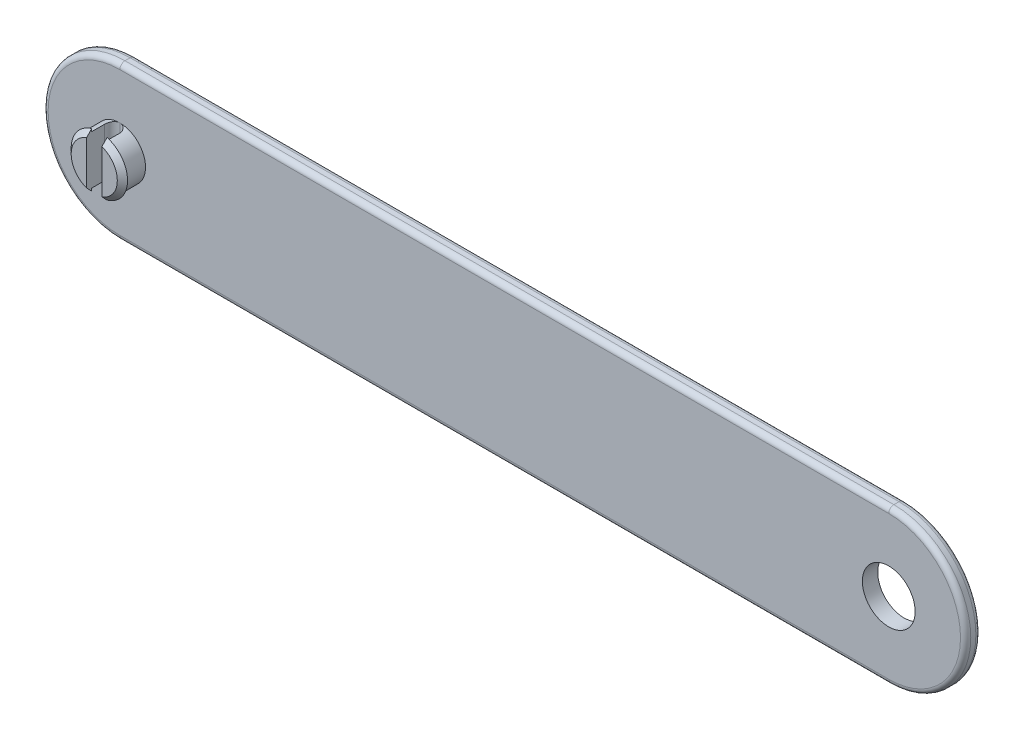
ISO-10303-21;
HEADER;
FILE_DESCRIPTION(('STEP AP214'),'2;1');
FILE_NAME('part.step','',(''),(''),'','','');
FILE_SCHEMA(('AUTOMOTIVE_DESIGN { 1 0 10303 214 1 1 1 1 }'));
ENDSEC;
DATA;
#1=APPLICATION_CONTEXT('core data for automotive mechanical design processes');
#2=APPLICATION_PROTOCOL_DEFINITION('international standard','automotive_design',2000,#1);
#3=PRODUCT_CONTEXT('',#1,'mechanical');
#4=PRODUCT('Part','Part','',(#3));
#5=PRODUCT_RELATED_PRODUCT_CATEGORY('part','',(#4));
#6=PRODUCT_DEFINITION_FORMATION('','',#4);
#7=PRODUCT_DEFINITION_CONTEXT('part definition',#1,'design');
#8=PRODUCT_DEFINITION('design','',#6,#7);
#9=PRODUCT_DEFINITION_SHAPE('','',#8);
#10=(LENGTH_UNIT() NAMED_UNIT(*) SI_UNIT(.MILLI.,.METRE.));
#11=(NAMED_UNIT(*) PLANE_ANGLE_UNIT() SI_UNIT($,.RADIAN.));
#12=(NAMED_UNIT(*) SI_UNIT($,.STERADIAN.) SOLID_ANGLE_UNIT());
#13=UNCERTAINTY_MEASURE_WITH_UNIT(LENGTH_MEASURE(1.E-05),#10,'distance_accuracy_value','');
#14=(GEOMETRIC_REPRESENTATION_CONTEXT(3) GLOBAL_UNCERTAINTY_ASSIGNED_CONTEXT((#13)) GLOBAL_UNIT_ASSIGNED_CONTEXT((#10,
#11,#12)) REPRESENTATION_CONTEXT('',''));
#15=CARTESIAN_POINT('',(0.,0.,0.));
#16=DIRECTION('',(0.,0.,1.));
#17=DIRECTION('',(1.,0.,0.));
#18=AXIS2_PLACEMENT_3D('',#15,#16,#17);
#19=CARTESIAN_POINT('',(0.,0.,3.));
#20=DIRECTION('',(0.,0.,1.));
#21=DIRECTION('',(1.,0.,0.));
#22=AXIS2_PLACEMENT_3D('',#19,#20,#21);
#23=PLANE('',#22);
#24=DIRECTION('',(1.,0.,0.));
#25=VECTOR('',#24,1.);
#26=CARTESIAN_POINT('',(0.,14.,3.));
#27=LINE('',#26,#25);
#28=CARTESIAN_POINT('',(150.,14.,3.));
#29=VERTEX_POINT('',#28);
#30=CARTESIAN_POINT('',(0.,14.,3.));
#31=VERTEX_POINT('',#30);
#32=EDGE_CURVE('E318',#29,#31,#27,.F.);
#33=ORIENTED_EDGE('',*,*,#32,.T.);
#34=CARTESIAN_POINT('',(0.,0.,3.));
#35=DIRECTION('',(0.,0.,1.));
#36=DIRECTION('',(1.,0.,0.));
#37=AXIS2_PLACEMENT_3D('',#34,#35,#36);
#38=CIRCLE('',#37,14.);
#39=CARTESIAN_POINT('',(0.,-14.,3.));
#40=VERTEX_POINT('',#39);
#41=EDGE_CURVE('E323',#31,#40,#38,.T.);
#42=ORIENTED_EDGE('',*,*,#41,.T.);
#43=DIRECTION('',(1.,0.,0.));
#44=VECTOR('',#43,1.);
#45=CARTESIAN_POINT('',(150.,-14.,3.));
#46=LINE('',#45,#44);
#47=CARTESIAN_POINT('',(150.,-14.,3.));
#48=VERTEX_POINT('',#47);
#49=EDGE_CURVE('E63',#40,#48,#46,.T.);
#50=ORIENTED_EDGE('',*,*,#49,.T.);
#51=CARTESIAN_POINT('',(150.,0.,3.));
#52=DIRECTION('',(0.,0.,1.));
#53=DIRECTION('',(1.,0.,0.));
#54=AXIS2_PLACEMENT_3D('',#51,#52,#53);
#55=CIRCLE('',#54,14.);
#56=EDGE_CURVE('E320',#48,#29,#55,.T.);
#57=ORIENTED_EDGE('',*,*,#56,.T.);
#58=EDGE_LOOP('',(#33,#42,#50,#57));
#59=FACE_BOUND('',#58,.T.);
#60=CARTESIAN_POINT('',(150.,0.,3.));
#61=DIRECTION('',(0.,0.,1.));
#62=DIRECTION('',(1.,0.,0.));
#63=AXIS2_PLACEMENT_3D('',#60,#61,#62);
#64=CIRCLE('',#63,5.14999999999998);
#65=CARTESIAN_POINT('',(155.15,0.,3.));
#66=VERTEX_POINT('',#65);
#67=EDGE_CURVE('E399',#66,#66,#64,.F.);
#68=ORIENTED_EDGE('',*,*,#67,.T.);
#69=EDGE_LOOP('',(#68));
#70=FACE_BOUND('',#69,.T.);
#71=CARTESIAN_POINT('',(0.,0.,3.));
#72=DIRECTION('',(0.,0.,1.));
#73=DIRECTION('',(1.,0.,0.));
#74=AXIS2_PLACEMENT_3D('',#71,#72,#73);
#75=CIRCLE('',#74,5.);
#76=CARTESIAN_POINT('',(0.,5.,3.));
#77=VERTEX_POINT('',#76);
#78=CARTESIAN_POINT('',(0.,-5.,3.));
#79=VERTEX_POINT('',#78);
#80=EDGE_CURVE('E378',#77,#79,#75,.T.);
#81=ORIENTED_EDGE('',*,*,#80,.F.);
#82=CARTESIAN_POINT('',(0.,0.,3.));
#83=DIRECTION('',(0.,0.,1.));
#84=DIRECTION('',(1.,0.,0.));
#85=AXIS2_PLACEMENT_3D('',#82,#83,#84);
#86=CIRCLE('',#85,5.);
#87=EDGE_CURVE('E380',#79,#77,#86,.T.);
#88=ORIENTED_EDGE('',*,*,#87,.F.);
#89=EDGE_LOOP('',(#81,#88));
#90=FACE_BOUND('',#89,.T.);
#91=ADVANCED_FACE('F39',(#59,#70,#90),#23,.T.);
#92=CARTESIAN_POINT('',(0.,0.,3.));
#93=DIRECTION('',(0.,0.,-1.));
#94=DIRECTION('',(-1.,0.,0.));
#95=AXIS2_PLACEMENT_3D('',#92,#93,#94);
#96=CYLINDRICAL_SURFACE('',#95,15.);
#97=DIRECTION('',(0.,0.,-1.));
#98=VECTOR('',#97,1.);
#99=CARTESIAN_POINT('',(0.,15.,3.));
#100=LINE('',#99,#98);
#101=CARTESIAN_POINT('',(0.,15.,2.));
#102=VERTEX_POINT('',#101);
#103=CARTESIAN_POINT('',(0.,15.,1.));
#104=VERTEX_POINT('',#103);
#105=EDGE_CURVE('E366',#102,#104,#100,.T.);
#106=ORIENTED_EDGE('',*,*,#105,.T.);
#107=CARTESIAN_POINT('',(0.,0.,1.));
#108=DIRECTION('',(0.,0.,1.));
#109=DIRECTION('',(1.,0.,0.));
#110=AXIS2_PLACEMENT_3D('',#107,#108,#109);
#111=CIRCLE('',#110,15.);
#112=CARTESIAN_POINT('',(0.,-15.,1.));
#113=VERTEX_POINT('',#112);
#114=EDGE_CURVE('E298',#104,#113,#111,.T.);
#115=ORIENTED_EDGE('',*,*,#114,.T.);
#116=DIRECTION('',(0.,0.,-1.));
#117=VECTOR('',#116,1.);
#118=CARTESIAN_POINT('',(0.,-15.,3.));
#119=LINE('',#118,#117);
#120=CARTESIAN_POINT('',(0.,-15.,2.));
#121=VERTEX_POINT('',#120);
#122=EDGE_CURVE('E193',#121,#113,#119,.T.);
#123=ORIENTED_EDGE('',*,*,#122,.F.);
#124=CARTESIAN_POINT('',(0.,0.,2.));
#125=DIRECTION('',(0.,0.,1.));
#126=DIRECTION('',(1.,0.,0.));
#127=AXIS2_PLACEMENT_3D('',#124,#125,#126);
#128=CIRCLE('',#127,15.);
#129=EDGE_CURVE('E290',#121,#102,#128,.F.);
#130=ORIENTED_EDGE('',*,*,#129,.T.);
#131=EDGE_LOOP('',(#106,#115,#123,#130));
#132=FACE_BOUND('',#131,.T.);
#133=ADVANCED_FACE('F418',(#132),#96,.T.);
#134=CARTESIAN_POINT('',(0.,-15.,3.));
#135=DIRECTION('',(0.,1.,0.));
#136=DIRECTION('',(0.,0.,1.));
#137=AXIS2_PLACEMENT_3D('',#134,#135,#136);
#138=PLANE('',#137);
#139=ORIENTED_EDGE('',*,*,#122,.T.);
#140=DIRECTION('',(1.,0.,0.));
#141=VECTOR('',#140,1.);
#142=CARTESIAN_POINT('',(0.,-15.,1.));
#143=LINE('',#142,#141);
#144=CARTESIAN_POINT('',(150.,-15.,1.));
#145=VERTEX_POINT('',#144);
#146=EDGE_CURVE('E312',#113,#145,#143,.T.);
#147=ORIENTED_EDGE('',*,*,#146,.T.);
#148=DIRECTION('',(0.,0.,-1.));
#149=VECTOR('',#148,1.);
#150=CARTESIAN_POINT('',(150.,-15.,3.));
#151=LINE('',#150,#149);
#152=CARTESIAN_POINT('',(150.,-15.,2.));
#153=VERTEX_POINT('',#152);
#154=EDGE_CURVE('E356',#153,#145,#151,.T.);
#155=ORIENTED_EDGE('',*,*,#154,.F.);
#156=DIRECTION('',(1.,0.,0.));
#157=VECTOR('',#156,1.);
#158=CARTESIAN_POINT('',(0.,-15.,2.));
#159=LINE('',#158,#157);
#160=EDGE_CURVE('E310',#153,#121,#159,.F.);
#161=ORIENTED_EDGE('',*,*,#160,.T.);
#162=EDGE_LOOP('',(#139,#147,#155,#161));
#163=FACE_BOUND('',#162,.T.);
#164=ADVANCED_FACE('F362',(#163),#138,.F.);
#165=CARTESIAN_POINT('',(150.,0.,3.));
#166=DIRECTION('',(0.,0.,-1.));
#167=DIRECTION('',(-1.,0.,0.));
#168=AXIS2_PLACEMENT_3D('',#165,#166,#167);
#169=CYLINDRICAL_SURFACE('',#168,15.);
#170=ORIENTED_EDGE('',*,*,#154,.T.);
#171=CARTESIAN_POINT('',(150.,0.,1.));
#172=DIRECTION('',(0.,0.,1.));
#173=DIRECTION('',(1.,0.,0.));
#174=AXIS2_PLACEMENT_3D('',#171,#172,#173);
#175=CIRCLE('',#174,15.);
#176=CARTESIAN_POINT('',(150.,15.,1.));
#177=VERTEX_POINT('',#176);
#178=EDGE_CURVE('E316',#145,#177,#175,.T.);
#179=ORIENTED_EDGE('',*,*,#178,.T.);
#180=DIRECTION('',(0.,0.,-1.));
#181=VECTOR('',#180,1.);
#182=CARTESIAN_POINT('',(150.,15.,3.));
#183=LINE('',#182,#181);
#184=CARTESIAN_POINT('',(150.,15.,2.));
#185=VERTEX_POINT('',#184);
#186=EDGE_CURVE('E359',#185,#177,#183,.T.);
#187=ORIENTED_EDGE('',*,*,#186,.F.);
#188=CARTESIAN_POINT('',(150.,0.,2.));
#189=DIRECTION('',(0.,0.,1.));
#190=DIRECTION('',(1.,0.,0.));
#191=AXIS2_PLACEMENT_3D('',#188,#189,#190);
#192=CIRCLE('',#191,15.);
#193=EDGE_CURVE('E314',#185,#153,#192,.F.);
#194=ORIENTED_EDGE('',*,*,#193,.T.);
#195=EDGE_LOOP('',(#170,#179,#187,#194));
#196=FACE_BOUND('',#195,.T.);
#197=ADVANCED_FACE('F355',(#196),#169,.T.);
#198=CARTESIAN_POINT('',(0.,15.,3.));
#199=DIRECTION('',(0.,1.,0.));
#200=DIRECTION('',(0.,0.,1.));
#201=AXIS2_PLACEMENT_3D('',#198,#199,#200);
#202=PLANE('',#201);
#203=ORIENTED_EDGE('',*,*,#186,.T.);
#204=DIRECTION('',(1.,0.,0.));
#205=VECTOR('',#204,1.);
#206=CARTESIAN_POINT('',(0.,15.,1.));
#207=LINE('',#206,#205);
#208=EDGE_CURVE('E11',#177,#104,#207,.F.);
#209=ORIENTED_EDGE('',*,*,#208,.T.);
#210=ORIENTED_EDGE('',*,*,#105,.F.);
#211=DIRECTION('',(1.,0.,0.));
#212=VECTOR('',#211,1.);
#213=CARTESIAN_POINT('',(0.,15.,2.));
#214=LINE('',#213,#212);
#215=EDGE_CURVE('E48',#102,#185,#214,.T.);
#216=ORIENTED_EDGE('',*,*,#215,.T.);
#217=EDGE_LOOP('',(#203,#209,#210,#216));
#218=FACE_BOUND('',#217,.T.);
#219=ADVANCED_FACE('F427',(#218),#202,.T.);
#220=CARTESIAN_POINT('',(0.,0.,0.));
#221=DIRECTION('',(0.,0.,1.));
#222=DIRECTION('',(1.,0.,0.));
#223=AXIS2_PLACEMENT_3D('',#220,#221,#222);
#224=PLANE('',#223);
#225=DIRECTION('',(1.,0.,0.));
#226=VECTOR('',#225,1.);
#227=CARTESIAN_POINT('',(0.,-14.,0.));
#228=LINE('',#227,#226);
#229=CARTESIAN_POINT('',(150.,-14.,0.));
#230=VERTEX_POINT('',#229);
#231=CARTESIAN_POINT('',(0.,-14.,0.));
#232=VERTEX_POINT('',#231);
#233=EDGE_CURVE('E305',#230,#232,#228,.F.);
#234=ORIENTED_EDGE('',*,*,#233,.T.);
#235=CARTESIAN_POINT('',(0.,0.,0.));
#236=DIRECTION('',(0.,0.,1.));
#237=DIRECTION('',(1.,0.,0.));
#238=AXIS2_PLACEMENT_3D('',#235,#236,#237);
#239=CIRCLE('',#238,14.);
#240=CARTESIAN_POINT('',(0.,14.,0.));
#241=VERTEX_POINT('',#240);
#242=EDGE_CURVE('E307',#232,#241,#239,.F.);
#243=ORIENTED_EDGE('',*,*,#242,.T.);
#244=DIRECTION('',(1.,0.,0.));
#245=VECTOR('',#244,1.);
#246=CARTESIAN_POINT('',(150.,14.,0.));
#247=LINE('',#246,#245);
#248=CARTESIAN_POINT('',(150.,14.,0.));
#249=VERTEX_POINT('',#248);
#250=EDGE_CURVE('E301',#241,#249,#247,.T.);
#251=ORIENTED_EDGE('',*,*,#250,.T.);
#252=CARTESIAN_POINT('',(150.,0.,0.));
#253=DIRECTION('',(0.,0.,1.));
#254=DIRECTION('',(1.,0.,0.));
#255=AXIS2_PLACEMENT_3D('',#252,#253,#254);
#256=CIRCLE('',#255,14.);
#257=EDGE_CURVE('E303',#249,#230,#256,.F.);
#258=ORIENTED_EDGE('',*,*,#257,.T.);
#259=EDGE_LOOP('',(#234,#243,#251,#258));
#260=FACE_BOUND('',#259,.T.);
#261=CARTESIAN_POINT('',(150.,0.,0.));
#262=DIRECTION('',(0.,0.,1.));
#263=DIRECTION('',(1.,0.,0.));
#264=AXIS2_PLACEMENT_3D('',#261,#262,#263);
#265=CIRCLE('',#264,5.14999999999998);
#266=CARTESIAN_POINT('',(155.15,0.,0.));
#267=VERTEX_POINT('',#266);
#268=EDGE_CURVE('E294',#267,#267,#265,.T.);
#269=ORIENTED_EDGE('',*,*,#268,.T.);
#270=EDGE_LOOP('',(#269));
#271=FACE_BOUND('',#270,.T.);
#272=ADVANCED_FACE('F406',(#260,#271),#224,.F.);
#273=CARTESIAN_POINT('',(0.,0.,7.));
#274=DIRECTION('',(0.,0.,-1.));
#275=DIRECTION('',(-1.,0.,0.));
#276=AXIS2_PLACEMENT_3D('',#273,#274,#275);
#277=CYLINDRICAL_SURFACE('',#276,5.);
#278=ORIENTED_EDGE('',*,*,#80,.T.);
#279=CARTESIAN_POINT('',(0.,-5.,3.));
#280=CARTESIAN_POINT('',(-0.0412230773899798,-5.00000277613312,2.99999925912565));
#281=CARTESIAN_POINT('',(-0.082425557098246,-4.99948958398081,3.00170043926399));
#282=CARTESIAN_POINT('',(-0.164518730866947,-4.99746087704898,3.00848041599295));
#283=CARTESIAN_POINT('',(-0.205409485177793,-4.9959455611979,3.01355854223773));
#284=CARTESIAN_POINT('',(-0.326963301776201,-4.98995381331756,3.03377517530363));
#285=CARTESIAN_POINT('',(-0.406785158642713,-4.98403118606551,3.05389634922364));
#286=CARTESIAN_POINT('',(-0.561734538434264,-4.96895678681408,3.10674287914124));
#287=CARTESIAN_POINT('',(-0.636863069535107,-4.95980571114645,3.13946551731626));
#288=CARTESIAN_POINT('',(-0.780600785691843,-4.9392243551907,3.21652309467646));
#289=CARTESIAN_POINT('',(-0.849207204843492,-4.92779311423826,3.2608629308205));
#290=CARTESIAN_POINT('',(-0.97986969539363,-4.90350796272656,3.36122156640607));
#291=CARTESIAN_POINT('',(-1.0417124952522,-4.8906250718143,3.41751086871889));
#292=CARTESIAN_POINT('',(-1.15524422121796,-4.86505948668359,3.53960362636054));
#293=CARTESIAN_POINT('',(-1.20693049442307,-4.85237684556416,3.6054095596784));
#294=CARTESIAN_POINT('',(-1.29981663905891,-4.82833698781928,3.74649383123076));
#295=CARTESIAN_POINT('',(-1.34075062074078,-4.81701657361783,3.82195389706853));
#296=CARTESIAN_POINT('',(-1.40923482373452,-4.79742985037451,3.97905482734796));
#297=CARTESIAN_POINT('',(-1.43679764279335,-4.78916066835566,4.06068978989199));
#298=CARTESIAN_POINT('',(-1.47137173672671,-4.77862845517374,4.20226791879962));
#299=CARTESIAN_POINT('',(-1.48208442594249,-4.77530350348451,4.26125369965697));
#300=CARTESIAN_POINT('',(-1.49640626854262,-4.7708262463819,4.38014739106727));
#301=CARTESIAN_POINT('',(-1.5000169977961,-4.76967345898471,4.44005509407892));
#302=CARTESIAN_POINT('',(-1.5,-4.76969600708473,4.5));
#303=B_SPLINE_CURVE_WITH_KNOTS('',3,(#279,#280,#281,#282,#283,#284,#285,#286,#287,#288,#289,
#290,#291,#292,#293,#294,#295,#296,#297,#298,#299,#300,#301,#302),.UNSPECIFIED.,.F.,.F.,(4,2,2,
2,2,2,2,2,2,2,2,4),(0.,0.123590522760266,0.247156519315276,0.493467728235495,0.739725843675752,
0.986087930955972,1.23877207809718,1.49152213929098,1.75003354782293,2.00830092246139,
2.18798745648376,2.36763411497588),.UNSPECIFIED.);
#304=CARTESIAN_POINT('',(-1.5,-4.76969600708473,4.5));
#305=VERTEX_POINT('',#304);
#306=EDGE_CURVE('E284',#79,#305,#303,.T.);
#307=ORIENTED_EDGE('',*,*,#306,.T.);
#308=DIRECTION('',(0.,0.,-1.));
#309=VECTOR('',#308,1.);
#310=CARTESIAN_POINT('',(-1.5,-4.76969600708473,7.));
#311=LINE('',#310,#309);
#312=CARTESIAN_POINT('',(-1.5,-4.76969600708473,7.));
#313=VERTEX_POINT('',#312);
#314=EDGE_CURVE('E371',#313,#305,#311,.T.);
#315=ORIENTED_EDGE('',*,*,#314,.F.);
#316=CARTESIAN_POINT('',(0.,0.,7.));
#317=DIRECTION('',(0.,0.,1.));
#318=DIRECTION('',(1.,0.,0.));
#319=AXIS2_PLACEMENT_3D('',#316,#317,#318);
#320=CIRCLE('',#319,5.);
#321=CARTESIAN_POINT('',(-1.5,4.76969600708473,7.));
#322=VERTEX_POINT('',#321);
#323=EDGE_CURVE('E377',#322,#313,#320,.T.);
#324=ORIENTED_EDGE('',*,*,#323,.F.);
#325=DIRECTION('',(0.,0.,-1.));
#326=VECTOR('',#325,1.);
#327=CARTESIAN_POINT('',(-1.5,4.76969600708473,7.));
#328=LINE('',#327,#326);
#329=CARTESIAN_POINT('',(-1.5,4.76969600708473,4.5));
#330=VERTEX_POINT('',#329);
#331=EDGE_CURVE('E374',#322,#330,#328,.T.);
#332=ORIENTED_EDGE('',*,*,#331,.T.);
#333=CARTESIAN_POINT('',(-1.5,4.76969600708473,4.5));
#334=CARTESIAN_POINT('',(-1.50000085359986,4.76969248993095,4.45881918932386));
#335=CARTESIAN_POINT('',(-1.49830305374631,4.77023000663726,4.41765912115535));
#336=CARTESIAN_POINT('',(-1.49153727481279,4.77235113343356,4.33565320311231));
#337=CARTESIAN_POINT('',(-1.48647005385463,4.77393450820429,4.29480728464472));
#338=CARTESIAN_POINT('',(-1.46630065235378,4.78018533002168,4.17340395624687));
#339=CARTESIAN_POINT('',(-1.44623028637151,4.78635397305578,4.09369093965724));
#340=CARTESIAN_POINT('',(-1.39353147335906,4.80195939037487,3.93896571877284));
#341=CARTESIAN_POINT('',(-1.36090719903445,4.81139507864529,3.86395196214715));
#342=CARTESIAN_POINT('',(-1.28407985018232,4.8324653260204,3.7204056008968));
#343=CARTESIAN_POINT('',(-1.23987100279312,4.8441009806121,3.65187625084195));
#344=CARTESIAN_POINT('',(-1.13964930893702,4.86866818200433,3.5211348309649));
#345=CARTESIAN_POINT('',(-1.08333633607985,4.88162718483485,3.45915804950034));
#346=CARTESIAN_POINT('',(-0.961140113903202,4.90714781796852,3.34536568202602));
#347=CARTESIAN_POINT('',(-0.895255002005047,4.9197093703538,3.2935520782231));
#348=CARTESIAN_POINT('',(-0.754090160225413,4.94333592434221,3.2005222228324));
#349=CARTESIAN_POINT('',(-0.678642338077988,4.95436400128813,3.15955109688797));
#350=CARTESIAN_POINT('',(-0.521563369050342,4.97335005202751,3.0909932692418));
#351=CARTESIAN_POINT('',(-0.43993764984166,4.98131068415015,3.06339497292421));
#352=CARTESIAN_POINT('',(-0.298264456021694,4.99143710038863,3.02873103887292));
#353=CARTESIAN_POINT('',(-0.239166490668785,4.99462764738926,3.01797863412638));
#354=CARTESIAN_POINT('',(-0.120057391419018,4.99891817852599,3.00360598264217));
#355=CARTESIAN_POINT('',(-0.0600465820525033,5.00001888889584,2.99998325827159));
#356=CARTESIAN_POINT('',(0.,5.,3.));
#357=B_SPLINE_CURVE_WITH_KNOTS('',3,(#333,#334,#335,#336,#337,#338,#339,#340,#341,#342,#343,
#344,#345,#346,#347,#348,#349,#350,#351,#352,#353,#354,#355,#356),.UNSPECIFIED.,.F.,.F.,(4,2,2,
2,2,2,2,2,2,2,2,4),(0.,0.123463321048067,0.246898872168488,0.492911372366582,0.738842172727396,
0.984895759946681,1.23795183323011,1.49105721311967,1.74947248420819,2.00766329935825,
2.1876802778492,2.36763468764484),.UNSPECIFIED.);
#358=EDGE_CURVE('E277',#330,#77,#357,.T.);
#359=ORIENTED_EDGE('',*,*,#358,.T.);
#360=EDGE_LOOP('',(#278,#307,#315,#324,#332,#359));
#361=FACE_BOUND('',#360,.T.);
#362=ADVANCED_FACE('F224',(#361),#277,.T.);
#363=CARTESIAN_POINT('',(-1.5,4.76969600708473,7.));
#364=DIRECTION('',(-1.,0.,0.));
#365=DIRECTION('',(0.,0.,1.));
#366=AXIS2_PLACEMENT_3D('',#363,#364,#365);
#367=PLANE('',#366);
#368=ORIENTED_EDGE('',*,*,#314,.T.);
#369=DIRECTION('',(0.,1.,0.));
#370=VECTOR('',#369,1.);
#371=CARTESIAN_POINT('',(-1.5,4.76969600708473,4.5));
#372=LINE('',#371,#370);
#373=EDGE_CURVE('E705',#305,#330,#372,.T.);
#374=ORIENTED_EDGE('',*,*,#373,.T.);
#375=ORIENTED_EDGE('',*,*,#331,.F.);
#376=DIRECTION('',(0.,1.,0.));
#377=VECTOR('',#376,1.);
#378=CARTESIAN_POINT('',(-1.5,5.29150262212918,7.));
#379=LINE('',#378,#377);
#380=CARTESIAN_POINT('',(-1.5,5.29150262212918,7.));
#381=VERTEX_POINT('',#380);
#382=EDGE_CURVE('E394',#322,#381,#379,.T.);
#383=ORIENTED_EDGE('',*,*,#382,.T.);
#384=CARTESIAN_POINT('',(-1.5,5.29150262212918,7.00000000000001));
#385=CARTESIAN_POINT('',(-1.5,5.20447414806339,7.08372769626351));
#386=CARTESIAN_POINT('',(-1.5,5.11737049196802,7.1673773601956));
#387=CARTESIAN_POINT('',(-1.5,4.94298604304671,7.33449072927142));
#388=CARTESIAN_POINT('',(-1.5,4.85570525133475,7.41795443557776));
#389=CARTESIAN_POINT('',(-1.5,4.68093851584008,7.58466719096905));
#390=CARTESIAN_POINT('',(-1.5,4.59345257170058,7.66791623968014));
#391=CARTESIAN_POINT('',(-1.5,4.41823789495108,7.83415950995));
#392=CARTESIAN_POINT('',(-1.5,4.33050916081913,7.91715372990442));
#393=CARTESIAN_POINT('',(-1.5,4.24264068711932,8.));
#394=B_SPLINE_CURVE_WITH_KNOTS('',3,(#384,#385,#386,#387,#388,#389,#390,#391,#392,#393),
.UNSPECIFIED.,.F.,.F.,(4,2,2,2,4),(0.,0.362296270250921,0.724590269047716,1.08688489839679,
1.44918180400591),.UNSPECIFIED.);
#395=CARTESIAN_POINT('',(-1.5,4.24264068711932,8.));
#396=VERTEX_POINT('',#395);
#397=EDGE_CURVE('E230',#381,#396,#394,.T.);
#398=ORIENTED_EDGE('',*,*,#397,.T.);
#399=DIRECTION('',(0.,1.,0.));
#400=VECTOR('',#399,1.);
#401=CARTESIAN_POINT('',(-1.5,5.29150262212918,8.));
#402=LINE('',#401,#400);
#403=CARTESIAN_POINT('',(-1.5,-4.24264068711932,8.));
#404=VERTEX_POINT('',#403);
#405=EDGE_CURVE('E390',#404,#396,#402,.T.);
#406=ORIENTED_EDGE('',*,*,#405,.F.);
#407=CARTESIAN_POINT('',(-1.5,-4.24264068711932,8.));
#408=CARTESIAN_POINT('',(-1.5,-4.33050916081913,7.91715372990443));
#409=CARTESIAN_POINT('',(-1.5,-4.41823789495108,7.83415950995));
#410=CARTESIAN_POINT('',(-1.5,-4.59345257170058,7.66791623968014));
#411=CARTESIAN_POINT('',(-1.5,-4.68093851584008,7.58466719096905));
#412=CARTESIAN_POINT('',(-1.5,-4.85570525133475,7.41795443557776));
#413=CARTESIAN_POINT('',(-1.5,-4.94298604304671,7.33449072927142));
#414=CARTESIAN_POINT('',(-1.5,-5.11737049196802,7.1673773601956));
#415=CARTESIAN_POINT('',(-1.5,-5.20447414806339,7.08372769626351));
#416=CARTESIAN_POINT('',(-1.5,-5.29150262212918,7.00000000000001));
#417=B_SPLINE_CURVE_WITH_KNOTS('',3,(#407,#408,#409,#410,#411,#412,#413,#414,#415,#416),
.UNSPECIFIED.,.F.,.F.,(4,2,2,2,4),(0.,0.362296905609113,0.724591534958192,1.08688553375499,
1.44918180400591),.UNSPECIFIED.);
#418=CARTESIAN_POINT('',(-1.5,-5.29150262212918,7.));
#419=VERTEX_POINT('',#418);
#420=EDGE_CURVE('E236',#404,#419,#417,.T.);
#421=ORIENTED_EDGE('',*,*,#420,.T.);
#422=EDGE_CURVE('E391',#419,#313,#379,.T.);
#423=ORIENTED_EDGE('',*,*,#422,.T.);
#424=EDGE_LOOP('',(#368,#374,#375,#383,#398,#406,#421,#423));
#425=FACE_BOUND('',#424,.T.);
#426=ADVANCED_FACE('F219',(#425),#367,.F.);
#427=CARTESIAN_POINT('',(0.,0.,7.));
#428=DIRECTION('',(0.,0.,-1.));
#429=DIRECTION('',(-1.,0.,0.));
#430=AXIS2_PLACEMENT_3D('',#427,#428,#429);
#431=CYLINDRICAL_SURFACE('',#430,5.);
#432=ORIENTED_EDGE('',*,*,#87,.T.);
#433=CARTESIAN_POINT('',(0.,5.,3.));
#434=CARTESIAN_POINT('',(0.0412230773899829,5.00000277613312,2.99999925912565));
#435=CARTESIAN_POINT('',(0.0824255570982492,4.99948958398081,3.00170043926399));
#436=CARTESIAN_POINT('',(0.164518730866951,4.99746087704899,3.00848041599295));
#437=CARTESIAN_POINT('',(0.205409485177797,4.9959455611979,3.01355854223773));
#438=CARTESIAN_POINT('',(0.326963301776204,4.98995381331756,3.03377517530363));
#439=CARTESIAN_POINT('',(0.406785158642716,4.98403118606551,3.05389634922364));
#440=CARTESIAN_POINT('',(0.561734538434267,4.96895678681408,3.10674287914124));
#441=CARTESIAN_POINT('',(0.63686306953511,4.95980571114645,3.13946551731626));
#442=CARTESIAN_POINT('',(0.780600785691846,4.9392243551907,3.21652309467646));
#443=CARTESIAN_POINT('',(0.849207204843496,4.92779311423826,3.2608629308205));
#444=CARTESIAN_POINT('',(0.979869695393634,4.90350796272656,3.36122156640607));
#445=CARTESIAN_POINT('',(1.04171249525221,4.8906250718143,3.41751086871889));
#446=CARTESIAN_POINT('',(1.15524422121796,4.86505948668359,3.53960362636055));
#447=CARTESIAN_POINT('',(1.20693049442308,4.85237684556416,3.6054095596784));
#448=CARTESIAN_POINT('',(1.29981663905892,4.82833698781928,3.74649383123077));
#449=CARTESIAN_POINT('',(1.34075062074078,4.81701657361783,3.82195389706853));
#450=CARTESIAN_POINT('',(1.40923482373453,4.79742985037451,3.97905482734796));
#451=CARTESIAN_POINT('',(1.43679764279335,4.78916066835566,4.06068978989199));
#452=CARTESIAN_POINT('',(1.47137173672671,4.77862845517374,4.20226791879962));
#453=CARTESIAN_POINT('',(1.48208442594249,4.77530350348451,4.26125369965697));
#454=CARTESIAN_POINT('',(1.49640626854262,4.7708262463819,4.38014739106727));
#455=CARTESIAN_POINT('',(1.5000169977961,4.7696734589847,4.44005509407892));
#456=CARTESIAN_POINT('',(1.5,4.76969600708473,4.5));
#457=B_SPLINE_CURVE_WITH_KNOTS('',3,(#433,#434,#435,#436,#437,#438,#439,#440,#441,#442,#443,
#444,#445,#446,#447,#448,#449,#450,#451,#452,#453,#454,#455,#456),.UNSPECIFIED.,.F.,.F.,(4,2,2,
2,2,2,2,2,2,2,2,4),(0.,0.123590522760266,0.247156519315276,0.493467728235495,0.739725843675752,
0.986087930955972,1.23877207809718,1.49152213929098,1.75003354782293,2.00830092246139,
2.18798745648376,2.36763411497588),.UNSPECIFIED.);
#458=CARTESIAN_POINT('',(1.5,4.76969600708473,4.5));
#459=VERTEX_POINT('',#458);
#460=EDGE_CURVE('E271',#77,#459,#457,.T.);
#461=ORIENTED_EDGE('',*,*,#460,.T.);
#462=DIRECTION('',(0.,0.,-1.));
#463=VECTOR('',#462,1.);
#464=CARTESIAN_POINT('',(1.5,4.76969600708473,7.));
#465=LINE('',#464,#463);
#466=CARTESIAN_POINT('',(1.5,4.76969600708473,7.));
#467=VERTEX_POINT('',#466);
#468=EDGE_CURVE('E388',#467,#459,#465,.T.);
#469=ORIENTED_EDGE('',*,*,#468,.F.);
#470=CARTESIAN_POINT('',(0.,0.,7.));
#471=DIRECTION('',(0.,0.,1.));
#472=DIRECTION('',(1.,0.,0.));
#473=AXIS2_PLACEMENT_3D('',#470,#471,#472);
#474=CIRCLE('',#473,5.);
#475=CARTESIAN_POINT('',(1.5,-4.76969600708473,7.));
#476=VERTEX_POINT('',#475);
#477=EDGE_CURVE('E383',#476,#467,#474,.T.);
#478=ORIENTED_EDGE('',*,*,#477,.F.);
#479=DIRECTION('',(0.,0.,-1.));
#480=VECTOR('',#479,1.);
#481=CARTESIAN_POINT('',(1.5,-4.76969600708473,7.));
#482=LINE('',#481,#480);
#483=CARTESIAN_POINT('',(1.5,-4.76969600708473,4.5));
#484=VERTEX_POINT('',#483);
#485=EDGE_CURVE('E170',#476,#484,#482,.T.);
#486=ORIENTED_EDGE('',*,*,#485,.T.);
#487=CARTESIAN_POINT('',(1.5,-4.76969600708473,4.5));
#488=CARTESIAN_POINT('',(1.50000085359987,-4.76969248993095,4.45881918932386));
#489=CARTESIAN_POINT('',(1.49830305374632,-4.77023000663726,4.41765912115535));
#490=CARTESIAN_POINT('',(1.49153727481279,-4.77235113343356,4.33565320311231));
#491=CARTESIAN_POINT('',(1.48647005385463,-4.77393450820429,4.29480728464472));
#492=CARTESIAN_POINT('',(1.46630065235378,-4.78018533002168,4.17340395624687));
#493=CARTESIAN_POINT('',(1.44623028637152,-4.78635397305578,4.09369093965724));
#494=CARTESIAN_POINT('',(1.39353147335906,-4.80195939037487,3.93896571877284));
#495=CARTESIAN_POINT('',(1.36090719903445,-4.81139507864529,3.86395196214715));
#496=CARTESIAN_POINT('',(1.28407985018232,-4.8324653260204,3.7204056008968));
#497=CARTESIAN_POINT('',(1.23987100279312,-4.8441009806121,3.65187625084195));
#498=CARTESIAN_POINT('',(1.13964930893702,-4.86866818200433,3.5211348309649));
#499=CARTESIAN_POINT('',(1.08333633607985,-4.88162718483485,3.45915804950034));
#500=CARTESIAN_POINT('',(0.961140113903205,-4.90714781796852,3.34536568202602));
#501=CARTESIAN_POINT('',(0.895255002005051,-4.9197093703538,3.2935520782231));
#502=CARTESIAN_POINT('',(0.754090160225417,-4.94333592434221,3.2005222228324));
#503=CARTESIAN_POINT('',(0.678642338077992,-4.95436400128813,3.15955109688797));
#504=CARTESIAN_POINT('',(0.521563369050345,-4.97335005202751,3.0909932692418));
#505=CARTESIAN_POINT('',(0.439937649841664,-4.98131068415015,3.06339497292421));
#506=CARTESIAN_POINT('',(0.298264456021697,-4.99143710038863,3.02873103887292));
#507=CARTESIAN_POINT('',(0.239166490668788,-4.99462764738926,3.01797863412638));
#508=CARTESIAN_POINT('',(0.120057391419021,-4.99891817852599,3.00360598264217));
#509=CARTESIAN_POINT('',(0.0600465820525062,-5.00001888889584,2.99998325827159));
#510=CARTESIAN_POINT('',(0.,-5.,3.));
#511=B_SPLINE_CURVE_WITH_KNOTS('',3,(#487,#488,#489,#490,#491,#492,#493,#494,#495,#496,#497,
#498,#499,#500,#501,#502,#503,#504,#505,#506,#507,#508,#509,#510),.UNSPECIFIED.,.F.,.F.,(4,2,2,
2,2,2,2,2,2,2,2,4),(0.,0.123463321048067,0.246898872168488,0.492911372366582,0.738842172727396,
0.984895759946681,1.23795183323011,1.49105721311967,1.74947248420819,2.00766329935825,
2.1876802778492,2.36763468764484),.UNSPECIFIED.);
#512=EDGE_CURVE('E265',#484,#79,#511,.T.);
#513=ORIENTED_EDGE('',*,*,#512,.T.);
#514=EDGE_LOOP('',(#432,#461,#469,#478,#486,#513));
#515=FACE_BOUND('',#514,.T.);
#516=ADVANCED_FACE('F216',(#515),#431,.T.);
#517=CARTESIAN_POINT('',(1.5,4.76969600708473,7.));
#518=DIRECTION('',(1.,0.,0.));
#519=DIRECTION('',(0.,0.,-1.));
#520=AXIS2_PLACEMENT_3D('',#517,#518,#519);
#521=PLANE('',#520);
#522=ORIENTED_EDGE('',*,*,#468,.T.);
#523=DIRECTION('',(0.,-1.,0.));
#524=VECTOR('',#523,1.);
#525=CARTESIAN_POINT('',(1.5,4.76969600708473,4.5));
#526=LINE('',#525,#524);
#527=EDGE_CURVE('E242',#459,#484,#526,.T.);
#528=ORIENTED_EDGE('',*,*,#527,.T.);
#529=ORIENTED_EDGE('',*,*,#485,.F.);
#530=DIRECTION('',(0.,-1.,0.));
#531=VECTOR('',#530,1.);
#532=CARTESIAN_POINT('',(1.5,5.29150262212918,7.));
#533=LINE('',#532,#531);
#534=CARTESIAN_POINT('',(1.5,-5.29150262212918,7.));
#535=VERTEX_POINT('',#534);
#536=EDGE_CURVE('E160',#476,#535,#533,.T.);
#537=ORIENTED_EDGE('',*,*,#536,.T.);
#538=CARTESIAN_POINT('',(1.5,-5.29150262212918,7.00000000000001));
#539=CARTESIAN_POINT('',(1.5,-5.20447414806339,7.08372769626351));
#540=CARTESIAN_POINT('',(1.5,-5.11737049196802,7.1673773601956));
#541=CARTESIAN_POINT('',(1.5,-4.94298604304671,7.33449072927142));
#542=CARTESIAN_POINT('',(1.5,-4.85570525133475,7.41795443557776));
#543=CARTESIAN_POINT('',(1.5,-4.68093851584008,7.58466719096905));
#544=CARTESIAN_POINT('',(1.5,-4.59345257170058,7.66791623968014));
#545=CARTESIAN_POINT('',(1.5,-4.41823789495108,7.83415950995));
#546=CARTESIAN_POINT('',(1.5,-4.33050916081913,7.91715372990443));
#547=CARTESIAN_POINT('',(1.5,-4.24264068711932,8.));
#548=B_SPLINE_CURVE_WITH_KNOTS('',3,(#538,#539,#540,#541,#542,#543,#544,#545,#546,#547),
.UNSPECIFIED.,.F.,.F.,(4,2,2,2,4),(0.,0.362296270250922,0.724590269047716,1.0868848983968,
1.44918180400591),.UNSPECIFIED.);
#549=CARTESIAN_POINT('',(1.5,-4.24264068711932,8.));
#550=VERTEX_POINT('',#549);
#551=EDGE_CURVE('E166',#535,#550,#548,.T.);
#552=ORIENTED_EDGE('',*,*,#551,.T.);
#553=DIRECTION('',(0.,-1.,0.));
#554=VECTOR('',#553,1.);
#555=CARTESIAN_POINT('',(1.5,5.29150262212918,8.));
#556=LINE('',#555,#554);
#557=CARTESIAN_POINT('',(1.5,4.24264068711932,8.));
#558=VERTEX_POINT('',#557);
#559=EDGE_CURVE('E175',#558,#550,#556,.T.);
#560=ORIENTED_EDGE('',*,*,#559,.F.);
#561=CARTESIAN_POINT('',(1.5,4.24264068711932,8.));
#562=CARTESIAN_POINT('',(1.5,4.33050916081913,7.91715372990443));
#563=CARTESIAN_POINT('',(1.5,4.41823789495108,7.83415950995));
#564=CARTESIAN_POINT('',(1.5,4.59345257170058,7.66791623968014));
#565=CARTESIAN_POINT('',(1.5,4.68093851584008,7.58466719096905));
#566=CARTESIAN_POINT('',(1.5,4.85570525133475,7.41795443557776));
#567=CARTESIAN_POINT('',(1.5,4.94298604304671,7.33449072927142));
#568=CARTESIAN_POINT('',(1.5,5.11737049196802,7.1673773601956));
#569=CARTESIAN_POINT('',(1.5,5.20447414806339,7.08372769626351));
#570=CARTESIAN_POINT('',(1.5,5.29150262212918,7.00000000000001));
#571=B_SPLINE_CURVE_WITH_KNOTS('',3,(#561,#562,#563,#564,#565,#566,#567,#568,#569,#570),
.UNSPECIFIED.,.F.,.F.,(4,2,2,2,4),(0.,0.362296905609114,0.724591534958192,1.08688553375499,
1.44918180400591),.UNSPECIFIED.);
#572=CARTESIAN_POINT('',(1.5,5.29150262212918,7.));
#573=VERTEX_POINT('',#572);
#574=EDGE_CURVE('E189',#558,#573,#571,.T.);
#575=ORIENTED_EDGE('',*,*,#574,.T.);
#576=EDGE_CURVE('E174',#573,#467,#533,.T.);
#577=ORIENTED_EDGE('',*,*,#576,.T.);
#578=EDGE_LOOP('',(#522,#528,#529,#537,#552,#560,#575,#577));
#579=FACE_BOUND('',#578,.T.);
#580=ADVANCED_FACE('F163',(#579),#521,.F.);
#581=CARTESIAN_POINT('',(0.,0.,8.));
#582=DIRECTION('',(0.,0.,1.));
#583=DIRECTION('',(1.,0.,0.));
#584=AXIS2_PLACEMENT_3D('',#581,#582,#583);
#585=PLANE('',#584);
#586=ORIENTED_EDGE('',*,*,#405,.T.);
#587=CARTESIAN_POINT('',(0.,0.,8.));
#588=DIRECTION('',(0.,0.,1.));
#589=DIRECTION('',(1.,0.,0.));
#590=AXIS2_PLACEMENT_3D('',#587,#588,#589);
#591=CIRCLE('',#590,4.50000000000003);
#592=EDGE_CURVE('E191',#396,#404,#591,.T.);
#593=ORIENTED_EDGE('',*,*,#592,.T.);
#594=EDGE_LOOP('',(#586,#593));
#595=FACE_BOUND('',#594,.T.);
#596=ADVANCED_FACE('F215',(#595),#585,.T.);
#597=CARTESIAN_POINT('',(0.,0.,7.));
#598=DIRECTION('',(0.,0.,1.));
#599=DIRECTION('',(1.,0.,0.));
#600=AXIS2_PLACEMENT_3D('',#597,#598,#599);
#601=PLANE('',#600);
#602=ORIENTED_EDGE('',*,*,#382,.F.);
#603=ORIENTED_EDGE('',*,*,#323,.T.);
#604=ORIENTED_EDGE('',*,*,#422,.F.);
#605=CARTESIAN_POINT('',(0.,0.,7.));
#606=DIRECTION('',(0.,0.,1.));
#607=DIRECTION('',(1.,0.,0.));
#608=AXIS2_PLACEMENT_3D('',#605,#606,#607);
#609=CIRCLE('',#608,5.5);
#610=EDGE_CURVE('E183',#381,#419,#609,.T.);
#611=ORIENTED_EDGE('',*,*,#610,.F.);
#612=EDGE_LOOP('',(#602,#603,#604,#611));
#613=FACE_BOUND('',#612,.T.);
#614=ADVANCED_FACE('F479',(#613),#601,.F.);
#615=CARTESIAN_POINT('',(0.,0.,8.));
#616=DIRECTION('',(0.,0.,1.));
#617=DIRECTION('',(1.,0.,0.));
#618=AXIS2_PLACEMENT_3D('',#615,#616,#617);
#619=PLANE('',#618);
#620=ORIENTED_EDGE('',*,*,#559,.T.);
#621=CARTESIAN_POINT('',(0.,0.,8.));
#622=DIRECTION('',(0.,0.,1.));
#623=DIRECTION('',(1.,0.,0.));
#624=AXIS2_PLACEMENT_3D('',#621,#622,#623);
#625=CIRCLE('',#624,4.50000000000003);
#626=EDGE_CURVE('E188',#550,#558,#625,.T.);
#627=ORIENTED_EDGE('',*,*,#626,.T.);
#628=EDGE_LOOP('',(#620,#627));
#629=FACE_BOUND('',#628,.T.);
#630=ADVANCED_FACE('F487',(#629),#619,.T.);
#631=CARTESIAN_POINT('',(0.,0.,7.));
#632=DIRECTION('',(0.,0.,1.));
#633=DIRECTION('',(1.,0.,0.));
#634=AXIS2_PLACEMENT_3D('',#631,#632,#633);
#635=PLANE('',#634);
#636=ORIENTED_EDGE('',*,*,#536,.F.);
#637=ORIENTED_EDGE('',*,*,#477,.T.);
#638=ORIENTED_EDGE('',*,*,#576,.F.);
#639=CARTESIAN_POINT('',(0.,0.,7.));
#640=DIRECTION('',(0.,0.,1.));
#641=DIRECTION('',(1.,0.,0.));
#642=AXIS2_PLACEMENT_3D('',#639,#640,#641);
#643=CIRCLE('',#642,5.5);
#644=EDGE_CURVE('E179',#535,#573,#643,.T.);
#645=ORIENTED_EDGE('',*,*,#644,.F.);
#646=EDGE_LOOP('',(#636,#637,#638,#645));
#647=FACE_BOUND('',#646,.T.);
#648=ADVANCED_FACE('F180',(#647),#635,.F.);
#649=CARTESIAN_POINT('',(0.,0.,8.));
#650=DIRECTION('',(0.,0.,-1.));
#651=DIRECTION('',(-1.,0.,0.));
#652=AXIS2_PLACEMENT_3D('',#649,#650,#651);
#653=CONICAL_SURFACE('',#652,4.50000000000003,0.785398163397439);
#654=ORIENTED_EDGE('',*,*,#551,.F.);
#655=ORIENTED_EDGE('',*,*,#644,.T.);
#656=ORIENTED_EDGE('',*,*,#574,.F.);
#657=ORIENTED_EDGE('',*,*,#626,.F.);
#658=EDGE_LOOP('',(#654,#655,#656,#657));
#659=FACE_BOUND('',#658,.T.);
#660=ADVANCED_FACE('F186',(#659),#653,.T.);
#661=CARTESIAN_POINT('',(0.,0.,8.));
#662=DIRECTION('',(0.,0.,-1.));
#663=DIRECTION('',(-1.,0.,0.));
#664=AXIS2_PLACEMENT_3D('',#661,#662,#663);
#665=CONICAL_SURFACE('',#664,4.50000000000003,0.785398163397439);
#666=ORIENTED_EDGE('',*,*,#397,.F.);
#667=ORIENTED_EDGE('',*,*,#610,.T.);
#668=ORIENTED_EDGE('',*,*,#420,.F.);
#669=ORIENTED_EDGE('',*,*,#592,.F.);
#670=EDGE_LOOP('',(#666,#667,#668,#669));
#671=FACE_BOUND('',#670,.T.);
#672=ADVANCED_FACE('F245',(#671),#665,.T.);
#673=CARTESIAN_POINT('',(150.,0.,5.));
#674=DIRECTION('',(0.,0.,-1.));
#675=DIRECTION('',(-1.,0.,0.));
#676=AXIS2_PLACEMENT_3D('',#673,#674,#675);
#677=CYLINDRICAL_SURFACE('',#676,5.14999999999998);
#678=ORIENTED_EDGE('',*,*,#67,.F.);
#679=EDGE_LOOP('',(#678));
#680=FACE_BOUND('',#679,.T.);
#681=ORIENTED_EDGE('',*,*,#268,.F.);
#682=EDGE_LOOP('',(#681));
#683=FACE_BOUND('',#682,.T.);
#684=ADVANCED_FACE('F251',(#680,#683),#677,.F.);
#685=CARTESIAN_POINT('',(0.,4.76969600708473,4.5));
#686=DIRECTION('',(0.,1.,0.));
#687=DIRECTION('',(0.,0.,1.));
#688=AXIS2_PLACEMENT_3D('',#685,#686,#687);
#689=CYLINDRICAL_SURFACE('',#688,1.5);
#690=DIRECTION('',(0.,1.,0.));
#691=VECTOR('',#690,1.);
#692=CARTESIAN_POINT('',(0.,0.,3.));
#693=LINE('',#692,#691);
#694=EDGE_CURVE('E291',#77,#79,#693,.F.);
#695=ORIENTED_EDGE('',*,*,#694,.F.);
#696=ORIENTED_EDGE('',*,*,#358,.F.);
#697=ORIENTED_EDGE('',*,*,#373,.F.);
#698=ORIENTED_EDGE('',*,*,#306,.F.);
#699=EDGE_LOOP('',(#695,#696,#697,#698));
#700=FACE_BOUND('',#699,.T.);
#701=ADVANCED_FACE('F259',(#700),#689,.F.);
#702=CARTESIAN_POINT('',(0.,4.76969600708473,4.5));
#703=DIRECTION('',(0.,-1.,0.));
#704=DIRECTION('',(0.,0.,-1.));
#705=AXIS2_PLACEMENT_3D('',#702,#703,#704);
#706=CYLINDRICAL_SURFACE('',#705,1.5);
#707=ORIENTED_EDGE('',*,*,#460,.F.);
#708=ORIENTED_EDGE('',*,*,#694,.T.);
#709=ORIENTED_EDGE('',*,*,#512,.F.);
#710=ORIENTED_EDGE('',*,*,#527,.F.);
#711=EDGE_LOOP('',(#707,#708,#709,#710));
#712=FACE_BOUND('',#711,.T.);
#713=ADVANCED_FACE('F253',(#712),#706,.F.);
#714=CARTESIAN_POINT('',(150.,0.,1.));
#715=DIRECTION('',(0.,0.,1.));
#716=DIRECTION('',(1.,0.,0.));
#717=AXIS2_PLACEMENT_3D('',#714,#715,#716);
#718=TOROIDAL_SURFACE('',#717,14.,1.);
#719=CARTESIAN_POINT('',(150.,-14.,1.));
#720=DIRECTION('',(-1.,0.,0.));
#721=DIRECTION('',(0.,0.,1.));
#722=AXIS2_PLACEMENT_3D('',#719,#720,#721);
#723=CIRCLE('',#722,1.);
#724=EDGE_CURVE('E330',#230,#145,#723,.T.);
#725=ORIENTED_EDGE('',*,*,#724,.F.);
#726=ORIENTED_EDGE('',*,*,#257,.F.);
#727=CARTESIAN_POINT('',(150.,14.,1.));
#728=DIRECTION('',(-1.,0.,0.));
#729=DIRECTION('',(0.,0.,1.));
#730=AXIS2_PLACEMENT_3D('',#727,#728,#729);
#731=CIRCLE('',#730,1.);
#732=EDGE_CURVE('E295',#177,#249,#731,.T.);
#733=ORIENTED_EDGE('',*,*,#732,.F.);
#734=ORIENTED_EDGE('',*,*,#178,.F.);
#735=EDGE_LOOP('',(#725,#726,#733,#734));
#736=FACE_BOUND('',#735,.T.);
#737=ADVANCED_FACE('F258',(#736),#718,.T.);
#738=CARTESIAN_POINT('',(0.,14.,1.));
#739=DIRECTION('',(-1.,0.,0.));
#740=DIRECTION('',(0.,0.,1.));
#741=AXIS2_PLACEMENT_3D('',#738,#739,#740);
#742=CYLINDRICAL_SURFACE('',#741,1.);
#743=ORIENTED_EDGE('',*,*,#732,.T.);
#744=ORIENTED_EDGE('',*,*,#250,.F.);
#745=CARTESIAN_POINT('',(0.,14.,1.));
#746=DIRECTION('',(-1.,0.,0.));
#747=DIRECTION('',(0.,0.,1.));
#748=AXIS2_PLACEMENT_3D('',#745,#746,#747);
#749=CIRCLE('',#748,1.);
#750=EDGE_CURVE('E328',#104,#241,#749,.T.);
#751=ORIENTED_EDGE('',*,*,#750,.F.);
#752=ORIENTED_EDGE('',*,*,#208,.F.);
#753=EDGE_LOOP('',(#743,#744,#751,#752));
#754=FACE_BOUND('',#753,.T.);
#755=ADVANCED_FACE('F539',(#754),#742,.T.);
#756=CARTESIAN_POINT('',(0.,-14.,1.));
#757=DIRECTION('',(1.,0.,0.));
#758=DIRECTION('',(0.,0.,-1.));
#759=AXIS2_PLACEMENT_3D('',#756,#757,#758);
#760=CYLINDRICAL_SURFACE('',#759,1.);
#761=ORIENTED_EDGE('',*,*,#724,.T.);
#762=ORIENTED_EDGE('',*,*,#146,.F.);
#763=CARTESIAN_POINT('',(0.,-14.,1.));
#764=DIRECTION('',(-1.,0.,0.));
#765=DIRECTION('',(0.,0.,1.));
#766=AXIS2_PLACEMENT_3D('',#763,#764,#765);
#767=CIRCLE('',#766,1.);
#768=EDGE_CURVE('E326',#232,#113,#767,.T.);
#769=ORIENTED_EDGE('',*,*,#768,.F.);
#770=ORIENTED_EDGE('',*,*,#233,.F.);
#771=EDGE_LOOP('',(#761,#762,#769,#770));
#772=FACE_BOUND('',#771,.T.);
#773=ADVANCED_FACE('F550',(#772),#760,.T.);
#774=CARTESIAN_POINT('',(0.,0.,1.));
#775=DIRECTION('',(0.,0.,1.));
#776=DIRECTION('',(1.,0.,0.));
#777=AXIS2_PLACEMENT_3D('',#774,#775,#776);
#778=TOROIDAL_SURFACE('',#777,14.,1.);
#779=ORIENTED_EDGE('',*,*,#750,.T.);
#780=ORIENTED_EDGE('',*,*,#242,.F.);
#781=ORIENTED_EDGE('',*,*,#768,.T.);
#782=ORIENTED_EDGE('',*,*,#114,.F.);
#783=EDGE_LOOP('',(#779,#780,#781,#782));
#784=FACE_BOUND('',#783,.T.);
#785=ADVANCED_FACE('F561',(#784),#778,.T.);
#786=CARTESIAN_POINT('',(150.,0.,2.));
#787=DIRECTION('',(0.,0.,1.));
#788=DIRECTION('',(1.,0.,0.));
#789=AXIS2_PLACEMENT_3D('',#786,#787,#788);
#790=TOROIDAL_SURFACE('',#789,14.,1.);
#791=CARTESIAN_POINT('',(150.,-14.,2.));
#792=DIRECTION('',(-1.,0.,0.));
#793=DIRECTION('',(0.,0.,1.));
#794=AXIS2_PLACEMENT_3D('',#791,#792,#793);
#795=CIRCLE('',#794,1.);
#796=EDGE_CURVE('E337',#153,#48,#795,.T.);
#797=ORIENTED_EDGE('',*,*,#796,.F.);
#798=ORIENTED_EDGE('',*,*,#193,.F.);
#799=CARTESIAN_POINT('',(150.,14.,2.));
#800=DIRECTION('',(-1.,0.,0.));
#801=DIRECTION('',(0.,0.,1.));
#802=AXIS2_PLACEMENT_3D('',#799,#800,#801);
#803=CIRCLE('',#802,1.);
#804=EDGE_CURVE('E43',#29,#185,#803,.T.);
#805=ORIENTED_EDGE('',*,*,#804,.F.);
#806=ORIENTED_EDGE('',*,*,#56,.F.);
#807=EDGE_LOOP('',(#797,#798,#805,#806));
#808=FACE_BOUND('',#807,.T.);
#809=ADVANCED_FACE('F41',(#808),#790,.T.);
#810=CARTESIAN_POINT('',(0.,14.,2.));
#811=DIRECTION('',(1.,0.,0.));
#812=DIRECTION('',(0.,0.,-1.));
#813=AXIS2_PLACEMENT_3D('',#810,#811,#812);
#814=CYLINDRICAL_SURFACE('',#813,1.);
#815=ORIENTED_EDGE('',*,*,#804,.T.);
#816=ORIENTED_EDGE('',*,*,#215,.F.);
#817=CARTESIAN_POINT('',(0.,14.,2.));
#818=DIRECTION('',(-1.,0.,0.));
#819=DIRECTION('',(0.,0.,1.));
#820=AXIS2_PLACEMENT_3D('',#817,#818,#819);
#821=CIRCLE('',#820,1.);
#822=EDGE_CURVE('E336',#31,#102,#821,.T.);
#823=ORIENTED_EDGE('',*,*,#822,.F.);
#824=ORIENTED_EDGE('',*,*,#32,.F.);
#825=EDGE_LOOP('',(#815,#816,#823,#824));
#826=FACE_BOUND('',#825,.T.);
#827=ADVANCED_FACE('F347',(#826),#814,.T.);
#828=CARTESIAN_POINT('',(0.,-14.,2.));
#829=DIRECTION('',(-1.,0.,0.));
#830=DIRECTION('',(0.,0.,1.));
#831=AXIS2_PLACEMENT_3D('',#828,#829,#830);
#832=CYLINDRICAL_SURFACE('',#831,1.);
#833=ORIENTED_EDGE('',*,*,#796,.T.);
#834=ORIENTED_EDGE('',*,*,#49,.F.);
#835=CARTESIAN_POINT('',(0.,-14.,2.));
#836=DIRECTION('',(-1.,0.,0.));
#837=DIRECTION('',(0.,0.,1.));
#838=AXIS2_PLACEMENT_3D('',#835,#836,#837);
#839=CIRCLE('',#838,1.);
#840=EDGE_CURVE('E56',#121,#40,#839,.T.);
#841=ORIENTED_EDGE('',*,*,#840,.F.);
#842=ORIENTED_EDGE('',*,*,#160,.F.);
#843=EDGE_LOOP('',(#833,#834,#841,#842));
#844=FACE_BOUND('',#843,.T.);
#845=ADVANCED_FACE('F589',(#844),#832,.T.);
#846=CARTESIAN_POINT('',(0.,0.,2.));
#847=DIRECTION('',(0.,0.,1.));
#848=DIRECTION('',(1.,0.,0.));
#849=AXIS2_PLACEMENT_3D('',#846,#847,#848);
#850=TOROIDAL_SURFACE('',#849,14.,1.);
#851=ORIENTED_EDGE('',*,*,#822,.T.);
#852=ORIENTED_EDGE('',*,*,#129,.F.);
#853=ORIENTED_EDGE('',*,*,#840,.T.);
#854=ORIENTED_EDGE('',*,*,#41,.F.);
#855=EDGE_LOOP('',(#851,#852,#853,#854));
#856=FACE_BOUND('',#855,.T.);
#857=ADVANCED_FACE('F598',(#856),#850,.T.);
#858=CLOSED_SHELL('',(#91,#133,#164,#197,#219,#272,#362,#426,#516,#580,#596,#614,#630,#648,#660,
#672,#684,#701,#713,#737,#755,#773,#785,#809,#827,#845,#857));
#859=MANIFOLD_SOLID_BREP('B2',#858);
#860=ADVANCED_BREP_SHAPE_REPRESENTATION('',(#18,#859),#14);
#861=SHAPE_DEFINITION_REPRESENTATION(#9,#860);
ENDSEC;
END-ISO-10303-21;
